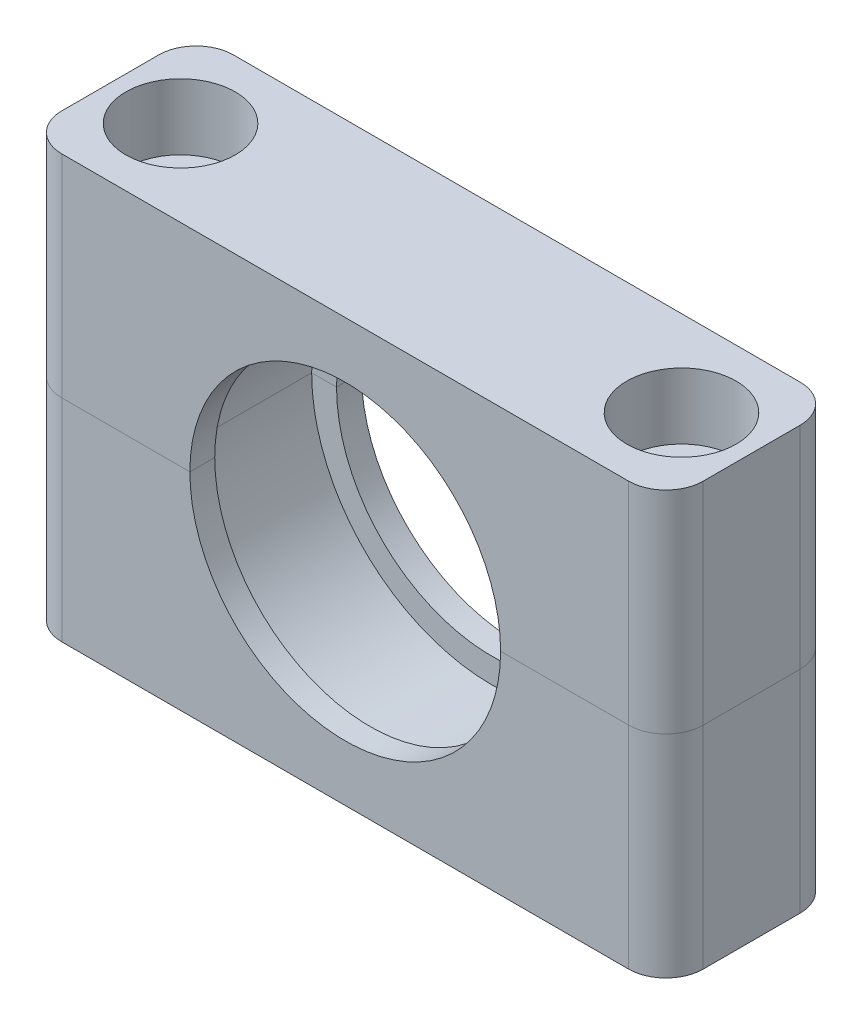
ISO-10303-21;
HEADER;
FILE_DESCRIPTION(('STEP AP214'),'2;1');
FILE_NAME('part.step','',(''),(''),'','','');
FILE_SCHEMA(('AUTOMOTIVE_DESIGN { 1 0 10303 214 1 1 1 1 }'));
ENDSEC;
DATA;
#1=APPLICATION_CONTEXT('core data for automotive mechanical design processes');
#2=APPLICATION_PROTOCOL_DEFINITION('international standard','automotive_design',2000,#1);
#3=PRODUCT_CONTEXT('',#1,'mechanical');
#4=PRODUCT('Part','Part','',(#3));
#5=PRODUCT_RELATED_PRODUCT_CATEGORY('part','',(#4));
#6=PRODUCT_DEFINITION_FORMATION('','',#4);
#7=PRODUCT_DEFINITION_CONTEXT('part definition',#1,'design');
#8=PRODUCT_DEFINITION('design','',#6,#7);
#9=PRODUCT_DEFINITION_SHAPE('','',#8);
#10=(LENGTH_UNIT() NAMED_UNIT(*) SI_UNIT(.MILLI.,.METRE.));
#11=(NAMED_UNIT(*) PLANE_ANGLE_UNIT() SI_UNIT($,.RADIAN.));
#12=(NAMED_UNIT(*) SI_UNIT($,.STERADIAN.) SOLID_ANGLE_UNIT());
#13=UNCERTAINTY_MEASURE_WITH_UNIT(LENGTH_MEASURE(1.E-05),#10,'distance_accuracy_value','');
#14=(GEOMETRIC_REPRESENTATION_CONTEXT(3) GLOBAL_UNCERTAINTY_ASSIGNED_CONTEXT((#13)) GLOBAL_UNIT_ASSIGNED_CONTEXT((#10,
#11,#12)) REPRESENTATION_CONTEXT('',''));
#15=CARTESIAN_POINT('',(0.,0.,0.));
#16=DIRECTION('',(0.,0.,1.));
#17=DIRECTION('',(1.,0.,0.));
#18=AXIS2_PLACEMENT_3D('',#15,#16,#17);
#19=CARTESIAN_POINT('',(0.,0.,0.));
#20=DIRECTION('',(0.,1.,0.));
#21=DIRECTION('',(0.,0.,1.));
#22=AXIS2_PLACEMENT_3D('',#19,#20,#21);
#23=PLANE('',#22);
#24=CARTESIAN_POINT('',(20.15,0.,4.75));
#25=DIRECTION('',(0.,1.,0.));
#26=DIRECTION('',(0.,0.,1.));
#27=AXIS2_PLACEMENT_3D('',#24,#25,#26);
#28=CIRCLE('',#27,2.65);
#29=CARTESIAN_POINT('',(20.15,0.,7.4));
#30=VERTEX_POINT('',#29);
#31=EDGE_CURVE('E243',#30,#30,#28,.F.);
#32=ORIENTED_EDGE('',*,*,#31,.T.);
#33=EDGE_LOOP('',(#32));
#34=FACE_BOUND('',#33,.T.);
#35=DIRECTION('',(-1.,0.,0.));
#36=VECTOR('',#35,1.);
#37=CARTESIAN_POINT('',(-25.8,0.,11.65));
#38=LINE('',#37,#36);
#39=CARTESIAN_POINT('',(22.8,0.,11.65));
#40=VERTEX_POINT('',#39);
#41=CARTESIAN_POINT('',(12.5,0.,11.65));
#42=VERTEX_POINT('',#41);
#43=EDGE_CURVE('E265',#40,#42,#38,.T.);
#44=ORIENTED_EDGE('',*,*,#43,.F.);
#45=CARTESIAN_POINT('',(22.8,0.,8.65));
#46=DIRECTION('',(0.,1.,0.));
#47=DIRECTION('',(0.,0.,1.));
#48=AXIS2_PLACEMENT_3D('',#45,#46,#47);
#49=CIRCLE('',#48,3.);
#50=CARTESIAN_POINT('',(25.8,0.,8.65));
#51=VERTEX_POINT('',#50);
#52=EDGE_CURVE('E199',#40,#51,#49,.T.);
#53=ORIENTED_EDGE('',*,*,#52,.T.);
#54=DIRECTION('',(0.,0.,1.));
#55=VECTOR('',#54,1.);
#56=CARTESIAN_POINT('',(25.8,0.,-2.15));
#57=LINE('',#56,#55);
#58=CARTESIAN_POINT('',(25.8,0.,0.850000000000002));
#59=VERTEX_POINT('',#58);
#60=EDGE_CURVE('E263',#59,#51,#57,.T.);
#61=ORIENTED_EDGE('',*,*,#60,.F.);
#62=CARTESIAN_POINT('',(22.8,0.,0.850000000000001));
#63=DIRECTION('',(0.,1.,0.));
#64=DIRECTION('',(0.,0.,1.));
#65=AXIS2_PLACEMENT_3D('',#62,#63,#64);
#66=CIRCLE('',#65,3.);
#67=CARTESIAN_POINT('',(22.8,0.,-2.15));
#68=VERTEX_POINT('',#67);
#69=EDGE_CURVE('E197',#59,#68,#66,.T.);
#70=ORIENTED_EDGE('',*,*,#69,.T.);
#71=DIRECTION('',(1.,0.,0.));
#72=VECTOR('',#71,1.);
#73=CARTESIAN_POINT('',(-25.8,0.,-2.15));
#74=LINE('',#73,#72);
#75=CARTESIAN_POINT('',(12.5,0.,-2.15));
#76=VERTEX_POINT('',#75);
#77=EDGE_CURVE('E232',#76,#68,#74,.T.);
#78=ORIENTED_EDGE('',*,*,#77,.F.);
#79=DIRECTION('',(0.,0.,-1.));
#80=VECTOR('',#79,1.);
#81=CARTESIAN_POINT('',(12.5,0.,-0.149999999999999));
#82=LINE('',#81,#80);
#83=CARTESIAN_POINT('',(12.5,0.,-0.149999999999999));
#84=VERTEX_POINT('',#83);
#85=EDGE_CURVE('E176',#76,#84,#82,.F.);
#86=ORIENTED_EDGE('',*,*,#85,.T.);
#87=DIRECTION('',(1.,0.,0.));
#88=VECTOR('',#87,1.);
#89=CARTESIAN_POINT('',(0.,0.,-0.149999999999999));
#90=LINE('',#89,#88);
#91=CARTESIAN_POINT('',(14.5,0.,-0.149999999999999));
#92=VERTEX_POINT('',#91);
#93=EDGE_CURVE('E157',#84,#92,#90,.T.);
#94=ORIENTED_EDGE('',*,*,#93,.T.);
#95=DIRECTION('',(0.,0.,1.));
#96=VECTOR('',#95,1.);
#97=CARTESIAN_POINT('',(14.5,0.,-2.15));
#98=LINE('',#97,#96);
#99=CARTESIAN_POINT('',(14.5,0.,9.65));
#100=VERTEX_POINT('',#99);
#101=EDGE_CURVE('E234',#92,#100,#98,.T.);
#102=ORIENTED_EDGE('',*,*,#101,.T.);
#103=DIRECTION('',(-1.,0.,0.));
#104=VECTOR('',#103,1.);
#105=CARTESIAN_POINT('',(0.,0.,9.65));
#106=LINE('',#105,#104);
#107=CARTESIAN_POINT('',(12.5,0.,9.65));
#108=VERTEX_POINT('',#107);
#109=EDGE_CURVE('E246',#100,#108,#106,.T.);
#110=ORIENTED_EDGE('',*,*,#109,.T.);
#111=DIRECTION('',(0.,0.,1.));
#112=VECTOR('',#111,1.);
#113=CARTESIAN_POINT('',(12.5,0.,9.65));
#114=LINE('',#113,#112);
#115=EDGE_CURVE('E172',#108,#42,#114,.T.);
#116=ORIENTED_EDGE('',*,*,#115,.T.);
#117=EDGE_LOOP('',(#44,#53,#61,#70,#78,#86,#94,#102,#110,#116));
#118=FACE_BOUND('',#117,.T.);
#119=ADVANCED_FACE('F50',(#34,#118),#23,.T.);
#120=CARTESIAN_POINT('',(-20.15,0.,4.75));
#121=DIRECTION('',(0.,1.,0.));
#122=DIRECTION('',(0.,0.,1.));
#123=AXIS2_PLACEMENT_3D('',#120,#121,#122);
#124=CIRCLE('',#123,2.65);
#125=CARTESIAN_POINT('',(-20.15,0.,7.4));
#126=VERTEX_POINT('',#125);
#127=EDGE_CURVE('E240',#126,#126,#124,.F.);
#128=ORIENTED_EDGE('',*,*,#127,.T.);
#129=EDGE_LOOP('',(#128));
#130=FACE_BOUND('',#129,.T.);
#131=CARTESIAN_POINT('',(-22.8,0.,-2.15));
#132=VERTEX_POINT('',#131);
#133=CARTESIAN_POINT('',(-12.5,0.,-2.15));
#134=VERTEX_POINT('',#133);
#135=EDGE_CURVE('E230',#132,#134,#74,.T.);
#136=ORIENTED_EDGE('',*,*,#135,.F.);
#137=CARTESIAN_POINT('',(-22.8,0.,0.850000000000001));
#138=DIRECTION('',(0.,1.,0.));
#139=DIRECTION('',(0.,0.,1.));
#140=AXIS2_PLACEMENT_3D('',#137,#138,#139);
#141=CIRCLE('',#140,3.);
#142=CARTESIAN_POINT('',(-25.8,0.,0.850000000000002));
#143=VERTEX_POINT('',#142);
#144=EDGE_CURVE('E65',#132,#143,#141,.T.);
#145=ORIENTED_EDGE('',*,*,#144,.T.);
#146=DIRECTION('',(0.,0.,-1.));
#147=VECTOR('',#146,1.);
#148=CARTESIAN_POINT('',(-25.8,0.,-2.15));
#149=LINE('',#148,#147);
#150=CARTESIAN_POINT('',(-25.8,0.,8.65));
#151=VERTEX_POINT('',#150);
#152=EDGE_CURVE('E223',#151,#143,#149,.T.);
#153=ORIENTED_EDGE('',*,*,#152,.F.);
#154=CARTESIAN_POINT('',(-22.8,0.,8.65));
#155=DIRECTION('',(0.,1.,0.));
#156=DIRECTION('',(0.,0.,1.));
#157=AXIS2_PLACEMENT_3D('',#154,#155,#156);
#158=CIRCLE('',#157,3.);
#159=CARTESIAN_POINT('',(-22.8,0.,11.65));
#160=VERTEX_POINT('',#159);
#161=EDGE_CURVE('E73',#151,#160,#158,.T.);
#162=ORIENTED_EDGE('',*,*,#161,.T.);
#163=CARTESIAN_POINT('',(-12.5,0.,11.65));
#164=VERTEX_POINT('',#163);
#165=EDGE_CURVE('E183',#164,#160,#38,.T.);
#166=ORIENTED_EDGE('',*,*,#165,.F.);
#167=DIRECTION('',(0.,0.,1.));
#168=VECTOR('',#167,1.);
#169=CARTESIAN_POINT('',(-12.5,0.,9.65));
#170=LINE('',#169,#168);
#171=CARTESIAN_POINT('',(-12.5,0.,9.65));
#172=VERTEX_POINT('',#171);
#173=EDGE_CURVE('E249',#164,#172,#170,.F.);
#174=ORIENTED_EDGE('',*,*,#173,.T.);
#175=CARTESIAN_POINT('',(-14.5,0.,9.65));
#176=VERTEX_POINT('',#175);
#177=EDGE_CURVE('E247',#172,#176,#106,.T.);
#178=ORIENTED_EDGE('',*,*,#177,.T.);
#179=DIRECTION('',(0.,0.,1.));
#180=VECTOR('',#179,1.);
#181=CARTESIAN_POINT('',(-14.5,0.,-2.15));
#182=LINE('',#181,#180);
#183=CARTESIAN_POINT('',(-14.5,0.,-0.149999999999999));
#184=VERTEX_POINT('',#183);
#185=EDGE_CURVE('E171',#176,#184,#182,.F.);
#186=ORIENTED_EDGE('',*,*,#185,.T.);
#187=CARTESIAN_POINT('',(-12.5,0.,-0.149999999999999));
#188=VERTEX_POINT('',#187);
#189=EDGE_CURVE('E155',#184,#188,#90,.T.);
#190=ORIENTED_EDGE('',*,*,#189,.T.);
#191=DIRECTION('',(0.,0.,-1.));
#192=VECTOR('',#191,1.);
#193=CARTESIAN_POINT('',(-12.5,0.,-0.149999999999999));
#194=LINE('',#193,#192);
#195=EDGE_CURVE('E168',#188,#134,#194,.T.);
#196=ORIENTED_EDGE('',*,*,#195,.T.);
#197=EDGE_LOOP('',(#136,#145,#153,#162,#166,#174,#178,#186,#190,#196));
#198=FACE_BOUND('',#197,.T.);
#199=ADVANCED_FACE('F167',(#130,#198),#23,.T.);
#200=CARTESIAN_POINT('',(0.,0.,-2.15));
#201=DIRECTION('',(0.,0.,1.));
#202=DIRECTION('',(1.,0.,0.));
#203=AXIS2_PLACEMENT_3D('',#200,#201,#202);
#204=CYLINDRICAL_SURFACE('',#203,14.5);
#205=ORIENTED_EDGE('',*,*,#185,.F.);
#206=CARTESIAN_POINT('',(0.,0.,9.65));
#207=DIRECTION('',(0.,0.,1.));
#208=DIRECTION('',(1.,0.,0.));
#209=AXIS2_PLACEMENT_3D('',#206,#207,#208);
#210=CIRCLE('',#209,14.5);
#211=EDGE_CURVE('E182',#100,#176,#210,.F.);
#212=ORIENTED_EDGE('',*,*,#211,.F.);
#213=ORIENTED_EDGE('',*,*,#101,.F.);
#214=CARTESIAN_POINT('',(0.,0.,-0.149999999999999));
#215=DIRECTION('',(0.,0.,-1.));
#216=DIRECTION('',(-1.,0.,0.));
#217=AXIS2_PLACEMENT_3D('',#214,#215,#216);
#218=CIRCLE('',#217,14.5);
#219=EDGE_CURVE('E180',#184,#92,#218,.F.);
#220=ORIENTED_EDGE('',*,*,#219,.F.);
#221=EDGE_LOOP('',(#205,#212,#213,#220));
#222=FACE_BOUND('',#221,.T.);
#223=ADVANCED_FACE('F305',(#222),#204,.F.);
#224=CARTESIAN_POINT('',(-25.8,-17.,-2.15));
#225=DIRECTION('',(-1.,0.,0.));
#226=DIRECTION('',(0.,0.,1.));
#227=AXIS2_PLACEMENT_3D('',#224,#225,#226);
#228=PLANE('',#227);
#229=ORIENTED_EDGE('',*,*,#152,.T.);
#230=DIRECTION('',(0.,1.,0.));
#231=VECTOR('',#230,1.);
#232=CARTESIAN_POINT('',(-25.8,-17.,0.850000000000002));
#233=LINE('',#232,#231);
#234=CARTESIAN_POINT('',(-25.8,-17.,0.850000000000002));
#235=VERTEX_POINT('',#234);
#236=EDGE_CURVE('E13',#143,#235,#233,.F.);
#237=ORIENTED_EDGE('',*,*,#236,.T.);
#238=DIRECTION('',(0.,0.,1.));
#239=VECTOR('',#238,1.);
#240=CARTESIAN_POINT('',(-25.8,-17.,-2.15));
#241=LINE('',#240,#239);
#242=CARTESIAN_POINT('',(-25.8,-17.,8.65));
#243=VERTEX_POINT('',#242);
#244=EDGE_CURVE('E226',#235,#243,#241,.T.);
#245=ORIENTED_EDGE('',*,*,#244,.T.);
#246=DIRECTION('',(0.,1.,0.));
#247=VECTOR('',#246,1.);
#248=CARTESIAN_POINT('',(-25.8,-17.,8.65));
#249=LINE('',#248,#247);
#250=EDGE_CURVE('E58',#243,#151,#249,.T.);
#251=ORIENTED_EDGE('',*,*,#250,.T.);
#252=EDGE_LOOP('',(#229,#237,#245,#251));
#253=FACE_BOUND('',#252,.T.);
#254=ADVANCED_FACE('F222',(#253),#228,.T.);
#255=CARTESIAN_POINT('',(-25.8,-17.,-2.15));
#256=DIRECTION('',(0.,0.,-1.));
#257=DIRECTION('',(-1.,0.,0.));
#258=AXIS2_PLACEMENT_3D('',#255,#256,#257);
#259=PLANE('',#258);
#260=ORIENTED_EDGE('',*,*,#77,.T.);
#261=DIRECTION('',(0.,1.,0.));
#262=VECTOR('',#261,1.);
#263=CARTESIAN_POINT('',(22.8,-17.,-2.15));
#264=LINE('',#263,#262);
#265=CARTESIAN_POINT('',(22.8,-17.,-2.15));
#266=VERTEX_POINT('',#265);
#267=EDGE_CURVE('E217',#68,#266,#264,.F.);
#268=ORIENTED_EDGE('',*,*,#267,.T.);
#269=DIRECTION('',(-1.,0.,0.));
#270=VECTOR('',#269,1.);
#271=CARTESIAN_POINT('',(-25.8,-17.,-2.15));
#272=LINE('',#271,#270);
#273=CARTESIAN_POINT('',(-22.8,-17.,-2.15));
#274=VERTEX_POINT('',#273);
#275=EDGE_CURVE('E185',#266,#274,#272,.T.);
#276=ORIENTED_EDGE('',*,*,#275,.T.);
#277=DIRECTION('',(0.,1.,0.));
#278=VECTOR('',#277,1.);
#279=CARTESIAN_POINT('',(-22.8,-17.,-2.15));
#280=LINE('',#279,#278);
#281=EDGE_CURVE('E214',#274,#132,#280,.T.);
#282=ORIENTED_EDGE('',*,*,#281,.T.);
#283=ORIENTED_EDGE('',*,*,#135,.T.);
#284=CARTESIAN_POINT('',(0.,0.,-2.15));
#285=DIRECTION('',(0.,0.,-1.));
#286=DIRECTION('',(-1.,0.,0.));
#287=AXIS2_PLACEMENT_3D('',#284,#285,#286);
#288=CIRCLE('',#287,12.5);
#289=EDGE_CURVE('E162',#76,#134,#288,.T.);
#290=ORIENTED_EDGE('',*,*,#289,.F.);
#291=EDGE_LOOP('',(#260,#268,#276,#282,#283,#290));
#292=FACE_BOUND('',#291,.T.);
#293=ADVANCED_FACE('F285',(#292),#259,.T.);
#294=CARTESIAN_POINT('',(25.8,-17.,-2.15));
#295=DIRECTION('',(1.,0.,0.));
#296=DIRECTION('',(0.,0.,-1.));
#297=AXIS2_PLACEMENT_3D('',#294,#295,#296);
#298=PLANE('',#297);
#299=ORIENTED_EDGE('',*,*,#60,.T.);
#300=DIRECTION('',(0.,1.,0.));
#301=VECTOR('',#300,1.);
#302=CARTESIAN_POINT('',(25.8,-17.,8.65));
#303=LINE('',#302,#301);
#304=CARTESIAN_POINT('',(25.8,-17.,8.65));
#305=VERTEX_POINT('',#304);
#306=EDGE_CURVE('E204',#51,#305,#303,.F.);
#307=ORIENTED_EDGE('',*,*,#306,.T.);
#308=DIRECTION('',(0.,0.,-1.));
#309=VECTOR('',#308,1.);
#310=CARTESIAN_POINT('',(25.8,-17.,-2.15));
#311=LINE('',#310,#309);
#312=CARTESIAN_POINT('',(25.8,-17.,0.850000000000002));
#313=VERTEX_POINT('',#312);
#314=EDGE_CURVE('E279',#305,#313,#311,.T.);
#315=ORIENTED_EDGE('',*,*,#314,.T.);
#316=DIRECTION('',(0.,1.,0.));
#317=VECTOR('',#316,1.);
#318=CARTESIAN_POINT('',(25.8,-17.,0.850000000000002));
#319=LINE('',#318,#317);
#320=EDGE_CURVE('E201',#313,#59,#319,.T.);
#321=ORIENTED_EDGE('',*,*,#320,.T.);
#322=EDGE_LOOP('',(#299,#307,#315,#321));
#323=FACE_BOUND('',#322,.T.);
#324=ADVANCED_FACE('F317',(#323),#298,.T.);
#325=CARTESIAN_POINT('',(-25.8,-17.,11.65));
#326=DIRECTION('',(0.,0.,1.));
#327=DIRECTION('',(1.,0.,0.));
#328=AXIS2_PLACEMENT_3D('',#325,#326,#327);
#329=PLANE('',#328);
#330=DIRECTION('',(1.,0.,0.));
#331=VECTOR('',#330,1.);
#332=CARTESIAN_POINT('',(-25.8,-17.,11.65));
#333=LINE('',#332,#331);
#334=CARTESIAN_POINT('',(-22.8,-17.,11.65));
#335=VERTEX_POINT('',#334);
#336=CARTESIAN_POINT('',(22.8,-17.,11.65));
#337=VERTEX_POINT('',#336);
#338=EDGE_CURVE('E276',#335,#337,#333,.T.);
#339=ORIENTED_EDGE('',*,*,#338,.T.);
#340=DIRECTION('',(0.,1.,0.));
#341=VECTOR('',#340,1.);
#342=CARTESIAN_POINT('',(22.8,-17.,11.65));
#343=LINE('',#342,#341);
#344=EDGE_CURVE('E194',#337,#40,#343,.T.);
#345=ORIENTED_EDGE('',*,*,#344,.T.);
#346=ORIENTED_EDGE('',*,*,#43,.T.);
#347=CARTESIAN_POINT('',(0.,0.,11.65));
#348=DIRECTION('',(0.,0.,1.));
#349=DIRECTION('',(1.,0.,0.));
#350=AXIS2_PLACEMENT_3D('',#347,#348,#349);
#351=CIRCLE('',#350,12.5);
#352=EDGE_CURVE('E163',#164,#42,#351,.T.);
#353=ORIENTED_EDGE('',*,*,#352,.F.);
#354=ORIENTED_EDGE('',*,*,#165,.T.);
#355=DIRECTION('',(0.,1.,0.));
#356=VECTOR('',#355,1.);
#357=CARTESIAN_POINT('',(-22.8,-17.,11.65));
#358=LINE('',#357,#356);
#359=EDGE_CURVE('E192',#160,#335,#358,.F.);
#360=ORIENTED_EDGE('',*,*,#359,.T.);
#361=EDGE_LOOP('',(#339,#345,#346,#353,#354,#360));
#362=FACE_BOUND('',#361,.T.);
#363=ADVANCED_FACE('F295',(#362),#329,.T.);
#364=CARTESIAN_POINT('',(-20.15,-17.,4.75));
#365=DIRECTION('',(0.,1.,0.));
#366=DIRECTION('',(0.,0.,1.));
#367=AXIS2_PLACEMENT_3D('',#364,#365,#366);
#368=CYLINDRICAL_SURFACE('',#367,2.65);
#369=CARTESIAN_POINT('',(-20.15,-17.,4.75));
#370=DIRECTION('',(0.,1.,0.));
#371=DIRECTION('',(0.,0.,1.));
#372=AXIS2_PLACEMENT_3D('',#369,#370,#371);
#373=CIRCLE('',#372,2.65);
#374=CARTESIAN_POINT('',(-20.15,-17.,7.4));
#375=VERTEX_POINT('',#374);
#376=EDGE_CURVE('E272',#375,#375,#373,.T.);
#377=ORIENTED_EDGE('',*,*,#376,.F.);
#378=EDGE_LOOP('',(#377));
#379=FACE_BOUND('',#378,.T.);
#380=ORIENTED_EDGE('',*,*,#127,.F.);
#381=EDGE_LOOP('',(#380));
#382=FACE_BOUND('',#381,.T.);
#383=ADVANCED_FACE('F330',(#379,#382),#368,.F.);
#384=CARTESIAN_POINT('',(20.15,-17.,4.75));
#385=DIRECTION('',(0.,1.,0.));
#386=DIRECTION('',(0.,0.,1.));
#387=AXIS2_PLACEMENT_3D('',#384,#385,#386);
#388=CYLINDRICAL_SURFACE('',#387,2.65);
#389=CARTESIAN_POINT('',(20.15,-17.,4.75));
#390=DIRECTION('',(0.,1.,0.));
#391=DIRECTION('',(0.,0.,-1.));
#392=AXIS2_PLACEMENT_3D('',#389,#390,#391);
#393=CIRCLE('',#392,2.65);
#394=CARTESIAN_POINT('',(20.15,-17.,2.1));
#395=VERTEX_POINT('',#394);
#396=EDGE_CURVE('E188',#395,#395,#393,.T.);
#397=ORIENTED_EDGE('',*,*,#396,.F.);
#398=EDGE_LOOP('',(#397));
#399=FACE_BOUND('',#398,.T.);
#400=ORIENTED_EDGE('',*,*,#31,.F.);
#401=EDGE_LOOP('',(#400));
#402=FACE_BOUND('',#401,.T.);
#403=ADVANCED_FACE('F327',(#399,#402),#388,.F.);
#404=CARTESIAN_POINT('',(0.,0.,9.65));
#405=DIRECTION('',(0.,0.,1.));
#406=DIRECTION('',(1.,0.,0.));
#407=AXIS2_PLACEMENT_3D('',#404,#405,#406);
#408=PLANE('',#407);
#409=ORIENTED_EDGE('',*,*,#109,.F.);
#410=ORIENTED_EDGE('',*,*,#211,.T.);
#411=ORIENTED_EDGE('',*,*,#177,.F.);
#412=CARTESIAN_POINT('',(0.,0.,9.65));
#413=DIRECTION('',(0.,0.,1.));
#414=DIRECTION('',(1.,0.,0.));
#415=AXIS2_PLACEMENT_3D('',#412,#413,#414);
#416=CIRCLE('',#415,12.5);
#417=EDGE_CURVE('E186',#172,#108,#416,.T.);
#418=ORIENTED_EDGE('',*,*,#417,.T.);
#419=EDGE_LOOP('',(#409,#410,#411,#418));
#420=FACE_BOUND('',#419,.T.);
#421=ADVANCED_FACE('F303',(#420),#408,.F.);
#422=CARTESIAN_POINT('',(0.,0.,9.65));
#423=DIRECTION('',(0.,0.,1.));
#424=DIRECTION('',(1.,0.,0.));
#425=AXIS2_PLACEMENT_3D('',#422,#423,#424);
#426=CYLINDRICAL_SURFACE('',#425,12.5);
#427=ORIENTED_EDGE('',*,*,#173,.F.);
#428=ORIENTED_EDGE('',*,*,#352,.T.);
#429=ORIENTED_EDGE('',*,*,#115,.F.);
#430=ORIENTED_EDGE('',*,*,#417,.F.);
#431=EDGE_LOOP('',(#427,#428,#429,#430));
#432=FACE_BOUND('',#431,.T.);
#433=ADVANCED_FACE('F299',(#432),#426,.F.);
#434=CARTESIAN_POINT('',(0.,0.,-0.149999999999999));
#435=DIRECTION('',(0.,0.,-1.));
#436=DIRECTION('',(-1.,0.,0.));
#437=AXIS2_PLACEMENT_3D('',#434,#435,#436);
#438=PLANE('',#437);
#439=ORIENTED_EDGE('',*,*,#189,.F.);
#440=ORIENTED_EDGE('',*,*,#219,.T.);
#441=ORIENTED_EDGE('',*,*,#93,.F.);
#442=CARTESIAN_POINT('',(0.,0.,-0.149999999999999));
#443=DIRECTION('',(0.,0.,-1.));
#444=DIRECTION('',(-1.,0.,0.));
#445=AXIS2_PLACEMENT_3D('',#442,#443,#444);
#446=CIRCLE('',#445,12.5);
#447=EDGE_CURVE('E152',#84,#188,#446,.T.);
#448=ORIENTED_EDGE('',*,*,#447,.T.);
#449=EDGE_LOOP('',(#439,#440,#441,#448));
#450=FACE_BOUND('',#449,.T.);
#451=ADVANCED_FACE('F154',(#450),#438,.F.);
#452=CARTESIAN_POINT('',(0.,0.,-0.149999999999999));
#453=DIRECTION('',(0.,0.,-1.));
#454=DIRECTION('',(-1.,0.,0.));
#455=AXIS2_PLACEMENT_3D('',#452,#453,#454);
#456=CYLINDRICAL_SURFACE('',#455,12.5);
#457=ORIENTED_EDGE('',*,*,#85,.F.);
#458=ORIENTED_EDGE('',*,*,#289,.T.);
#459=ORIENTED_EDGE('',*,*,#195,.F.);
#460=ORIENTED_EDGE('',*,*,#447,.F.);
#461=EDGE_LOOP('',(#457,#458,#459,#460));
#462=FACE_BOUND('',#461,.T.);
#463=ADVANCED_FACE('F175',(#462),#456,.F.);
#464=CARTESIAN_POINT('',(0.,-17.,0.));
#465=DIRECTION('',(0.,1.,0.));
#466=DIRECTION('',(0.,0.,1.));
#467=AXIS2_PLACEMENT_3D('',#464,#465,#466);
#468=PLANE('',#467);
#469=ORIENTED_EDGE('',*,*,#396,.T.);
#470=EDGE_LOOP('',(#469));
#471=FACE_BOUND('',#470,.T.);
#472=ORIENTED_EDGE('',*,*,#376,.T.);
#473=EDGE_LOOP('',(#472));
#474=FACE_BOUND('',#473,.T.);
#475=ORIENTED_EDGE('',*,*,#314,.F.);
#476=CARTESIAN_POINT('',(22.8,-17.,8.65));
#477=DIRECTION('',(0.,1.,0.));
#478=DIRECTION('',(0.,0.,1.));
#479=AXIS2_PLACEMENT_3D('',#476,#477,#478);
#480=CIRCLE('',#479,3.);
#481=EDGE_CURVE('E212',#305,#337,#480,.F.);
#482=ORIENTED_EDGE('',*,*,#481,.T.);
#483=ORIENTED_EDGE('',*,*,#338,.F.);
#484=CARTESIAN_POINT('',(-22.8,-17.,8.65));
#485=DIRECTION('',(0.,1.,0.));
#486=DIRECTION('',(0.,0.,1.));
#487=AXIS2_PLACEMENT_3D('',#484,#485,#486);
#488=CIRCLE('',#487,3.);
#489=EDGE_CURVE('E206',#335,#243,#488,.F.);
#490=ORIENTED_EDGE('',*,*,#489,.T.);
#491=ORIENTED_EDGE('',*,*,#244,.F.);
#492=CARTESIAN_POINT('',(-22.8,-17.,0.850000000000001));
#493=DIRECTION('',(0.,1.,0.));
#494=DIRECTION('',(0.,0.,1.));
#495=AXIS2_PLACEMENT_3D('',#492,#493,#494);
#496=CIRCLE('',#495,3.);
#497=EDGE_CURVE('E208',#235,#274,#496,.F.);
#498=ORIENTED_EDGE('',*,*,#497,.T.);
#499=ORIENTED_EDGE('',*,*,#275,.F.);
#500=CARTESIAN_POINT('',(22.8,-17.,0.850000000000001));
#501=DIRECTION('',(0.,1.,0.));
#502=DIRECTION('',(0.,0.,1.));
#503=AXIS2_PLACEMENT_3D('',#500,#501,#502);
#504=CIRCLE('',#503,3.);
#505=EDGE_CURVE('E210',#266,#313,#504,.F.);
#506=ORIENTED_EDGE('',*,*,#505,.T.);
#507=EDGE_LOOP('',(#475,#482,#483,#490,#491,#498,#499,#506));
#508=FACE_BOUND('',#507,.T.);
#509=ADVANCED_FACE('F292',(#471,#474,#508),#468,.F.);
#510=CARTESIAN_POINT('',(22.8,-17.,8.65));
#511=DIRECTION('',(0.,1.,0.));
#512=DIRECTION('',(0.,0.,1.));
#513=AXIS2_PLACEMENT_3D('',#510,#511,#512);
#514=CYLINDRICAL_SURFACE('',#513,3.);
#515=ORIENTED_EDGE('',*,*,#481,.F.);
#516=ORIENTED_EDGE('',*,*,#306,.F.);
#517=ORIENTED_EDGE('',*,*,#52,.F.);
#518=ORIENTED_EDGE('',*,*,#344,.F.);
#519=EDGE_LOOP('',(#515,#516,#517,#518));
#520=FACE_BOUND('',#519,.T.);
#521=ADVANCED_FACE('F333',(#520),#514,.T.);
#522=CARTESIAN_POINT('',(22.8,-17.,0.850000000000001));
#523=DIRECTION('',(0.,1.,0.));
#524=DIRECTION('',(0.,0.,1.));
#525=AXIS2_PLACEMENT_3D('',#522,#523,#524);
#526=CYLINDRICAL_SURFACE('',#525,3.);
#527=ORIENTED_EDGE('',*,*,#505,.F.);
#528=ORIENTED_EDGE('',*,*,#267,.F.);
#529=ORIENTED_EDGE('',*,*,#69,.F.);
#530=ORIENTED_EDGE('',*,*,#320,.F.);
#531=EDGE_LOOP('',(#527,#528,#529,#530));
#532=FACE_BOUND('',#531,.T.);
#533=ADVANCED_FACE('F336',(#532),#526,.T.);
#534=CARTESIAN_POINT('',(-22.8,-17.,0.850000000000001));
#535=DIRECTION('',(0.,1.,0.));
#536=DIRECTION('',(0.,0.,1.));
#537=AXIS2_PLACEMENT_3D('',#534,#535,#536);
#538=CYLINDRICAL_SURFACE('',#537,3.);
#539=ORIENTED_EDGE('',*,*,#497,.F.);
#540=ORIENTED_EDGE('',*,*,#236,.F.);
#541=ORIENTED_EDGE('',*,*,#144,.F.);
#542=ORIENTED_EDGE('',*,*,#281,.F.);
#543=EDGE_LOOP('',(#539,#540,#541,#542));
#544=FACE_BOUND('',#543,.T.);
#545=ADVANCED_FACE('F290',(#544),#538,.T.);
#546=CARTESIAN_POINT('',(-22.8,-17.,8.65));
#547=DIRECTION('',(0.,1.,0.));
#548=DIRECTION('',(0.,0.,1.));
#549=AXIS2_PLACEMENT_3D('',#546,#547,#548);
#550=CYLINDRICAL_SURFACE('',#549,3.);
#551=ORIENTED_EDGE('',*,*,#489,.F.);
#552=ORIENTED_EDGE('',*,*,#359,.F.);
#553=ORIENTED_EDGE('',*,*,#161,.F.);
#554=ORIENTED_EDGE('',*,*,#250,.F.);
#555=EDGE_LOOP('',(#551,#552,#553,#554));
#556=FACE_BOUND('',#555,.T.);
#557=ADVANCED_FACE('F52',(#556),#550,.T.);
#558=CLOSED_SHELL('',(#119,#199,#223,#254,#293,#324,#363,#383,#403,#421,#433,#451,#463,#509,
#521,#533,#545,#557));
#559=MANIFOLD_SOLID_BREP('B2',#558);
#560=CARTESIAN_POINT('',(20.15,-17.,4.75));
#561=DIRECTION('',(0.,1.,0.));
#562=DIRECTION('',(0.,0.,1.));
#563=AXIS2_PLACEMENT_3D('',#560,#561,#562);
#564=CYLINDRICAL_SURFACE('',#563,2.65);
#565=CARTESIAN_POINT('',(20.15,0.,4.75));
#566=DIRECTION('',(0.,1.,0.));
#567=DIRECTION('',(0.,0.,1.));
#568=AXIS2_PLACEMENT_3D('',#565,#566,#567);
#569=CIRCLE('',#568,2.65);
#570=CARTESIAN_POINT('',(20.15,0.,7.4));
#571=VERTEX_POINT('',#570);
#572=EDGE_CURVE('E682',#571,#571,#569,.F.);
#573=ORIENTED_EDGE('',*,*,#572,.T.);
#574=EDGE_LOOP('',(#573));
#575=FACE_BOUND('',#574,.T.);
#576=CARTESIAN_POINT('',(20.15,11.7,4.75));
#577=DIRECTION('',(0.,1.,0.));
#578=DIRECTION('',(0.,0.,1.));
#579=AXIS2_PLACEMENT_3D('',#576,#577,#578);
#580=CIRCLE('',#579,2.65);
#581=CARTESIAN_POINT('',(20.15,11.7,7.4));
#582=VERTEX_POINT('',#581);
#583=EDGE_CURVE('E703',#582,#582,#580,.F.);
#584=ORIENTED_EDGE('',*,*,#583,.F.);
#585=EDGE_LOOP('',(#584));
#586=FACE_BOUND('',#585,.T.);
#587=ADVANCED_FACE('F509',(#575,#586),#564,.F.);
#588=CARTESIAN_POINT('',(-20.15,-17.,4.75));
#589=DIRECTION('',(0.,1.,0.));
#590=DIRECTION('',(0.,0.,1.));
#591=AXIS2_PLACEMENT_3D('',#588,#589,#590);
#592=CYLINDRICAL_SURFACE('',#591,2.65);
#593=CARTESIAN_POINT('',(-20.15,0.,4.75));
#594=DIRECTION('',(0.,1.,0.));
#595=DIRECTION('',(0.,0.,1.));
#596=AXIS2_PLACEMENT_3D('',#593,#594,#595);
#597=CIRCLE('',#596,2.65);
#598=CARTESIAN_POINT('',(-20.15,0.,7.4));
#599=VERTEX_POINT('',#598);
#600=EDGE_CURVE('E692',#599,#599,#597,.F.);
#601=ORIENTED_EDGE('',*,*,#600,.T.);
#602=EDGE_LOOP('',(#601));
#603=FACE_BOUND('',#602,.T.);
#604=CARTESIAN_POINT('',(-20.15,11.7,4.75));
#605=DIRECTION('',(0.,1.,0.));
#606=DIRECTION('',(0.,0.,1.));
#607=AXIS2_PLACEMENT_3D('',#604,#605,#606);
#608=CIRCLE('',#607,2.65);
#609=CARTESIAN_POINT('',(-20.15,11.7,7.4));
#610=VERTEX_POINT('',#609);
#611=EDGE_CURVE('E700',#610,#610,#608,.F.);
#612=ORIENTED_EDGE('',*,*,#611,.F.);
#613=EDGE_LOOP('',(#612));
#614=FACE_BOUND('',#613,.T.);
#615=ADVANCED_FACE('F794',(#603,#614),#592,.F.);
#616=CARTESIAN_POINT('',(0.,0.,0.));
#617=DIRECTION('',(0.,1.,0.));
#618=DIRECTION('',(0.,0.,1.));
#619=AXIS2_PLACEMENT_3D('',#616,#617,#618);
#620=PLANE('',#619);
#621=DIRECTION('',(1.,0.,0.));
#622=VECTOR('',#621,1.);
#623=CARTESIAN_POINT('',(-25.8,0.,-2.15));
#624=LINE('',#623,#622);
#625=CARTESIAN_POINT('',(12.5,0.,-2.15));
#626=VERTEX_POINT('',#625);
#627=CARTESIAN_POINT('',(22.8,0.,-2.15));
#628=VERTEX_POINT('',#627);
#629=EDGE_CURVE('E671',#626,#628,#624,.T.);
#630=ORIENTED_EDGE('',*,*,#629,.T.);
#631=CARTESIAN_POINT('',(22.8,0.,0.850000000000001));
#632=DIRECTION('',(0.,1.,0.));
#633=DIRECTION('',(0.,0.,1.));
#634=AXIS2_PLACEMENT_3D('',#631,#632,#633);
#635=CIRCLE('',#634,3.);
#636=CARTESIAN_POINT('',(25.8,0.,0.850000000000002));
#637=VERTEX_POINT('',#636);
#638=EDGE_CURVE('E738',#628,#637,#635,.F.);
#639=ORIENTED_EDGE('',*,*,#638,.T.);
#640=DIRECTION('',(0.,0.,1.));
#641=VECTOR('',#640,1.);
#642=CARTESIAN_POINT('',(25.8,0.,-2.15));
#643=LINE('',#642,#641);
#644=CARTESIAN_POINT('',(25.8,0.,8.65));
#645=VERTEX_POINT('',#644);
#646=EDGE_CURVE('E674',#637,#645,#643,.T.);
#647=ORIENTED_EDGE('',*,*,#646,.T.);
#648=CARTESIAN_POINT('',(22.8,0.,8.65));
#649=DIRECTION('',(0.,1.,0.));
#650=DIRECTION('',(0.,0.,1.));
#651=AXIS2_PLACEMENT_3D('',#648,#649,#650);
#652=CIRCLE('',#651,3.);
#653=CARTESIAN_POINT('',(22.8,0.,11.65));
#654=VERTEX_POINT('',#653);
#655=EDGE_CURVE('E524',#645,#654,#652,.F.);
#656=ORIENTED_EDGE('',*,*,#655,.T.);
#657=DIRECTION('',(-1.,0.,0.));
#658=VECTOR('',#657,1.);
#659=CARTESIAN_POINT('',(-25.8,0.,11.65));
#660=LINE('',#659,#658);
#661=CARTESIAN_POINT('',(12.5,0.,11.65));
#662=VERTEX_POINT('',#661);
#663=EDGE_CURVE('E688',#654,#662,#660,.T.);
#664=ORIENTED_EDGE('',*,*,#663,.T.);
#665=DIRECTION('',(0.,0.,1.));
#666=VECTOR('',#665,1.);
#667=CARTESIAN_POINT('',(12.5,0.,9.65));
#668=LINE('',#667,#666);
#669=CARTESIAN_POINT('',(12.5,0.,9.65));
#670=VERTEX_POINT('',#669);
#671=EDGE_CURVE('E622',#670,#662,#668,.T.);
#672=ORIENTED_EDGE('',*,*,#671,.F.);
#673=DIRECTION('',(-1.,0.,0.));
#674=VECTOR('',#673,1.);
#675=CARTESIAN_POINT('',(0.,0.,9.65));
#676=LINE('',#675,#674);
#677=CARTESIAN_POINT('',(14.5,0.,9.65));
#678=VERTEX_POINT('',#677);
#679=EDGE_CURVE('E680',#678,#670,#676,.T.);
#680=ORIENTED_EDGE('',*,*,#679,.F.);
#681=DIRECTION('',(0.,0.,1.));
#682=VECTOR('',#681,1.);
#683=CARTESIAN_POINT('',(14.5,0.,-2.15));
#684=LINE('',#683,#682);
#685=CARTESIAN_POINT('',(14.5,0.,-0.149999999999999));
#686=VERTEX_POINT('',#685);
#687=EDGE_CURVE('E679',#686,#678,#684,.T.);
#688=ORIENTED_EDGE('',*,*,#687,.F.);
#689=DIRECTION('',(1.,0.,0.));
#690=VECTOR('',#689,1.);
#691=CARTESIAN_POINT('',(0.,0.,-0.149999999999999));
#692=LINE('',#691,#690);
#693=CARTESIAN_POINT('',(12.5,0.,-0.149999999999999));
#694=VERTEX_POINT('',#693);
#695=EDGE_CURVE('E623',#694,#686,#692,.T.);
#696=ORIENTED_EDGE('',*,*,#695,.F.);
#697=DIRECTION('',(0.,0.,-1.));
#698=VECTOR('',#697,1.);
#699=CARTESIAN_POINT('',(12.5,0.,-0.149999999999999));
#700=LINE('',#699,#698);
#701=EDGE_CURVE('E635',#626,#694,#700,.F.);
#702=ORIENTED_EDGE('',*,*,#701,.F.);
#703=EDGE_LOOP('',(#630,#639,#647,#656,#664,#672,#680,#688,#696,#702));
#704=FACE_BOUND('',#703,.T.);
#705=ORIENTED_EDGE('',*,*,#572,.F.);
#706=EDGE_LOOP('',(#705));
#707=FACE_BOUND('',#706,.T.);
#708=ADVANCED_FACE('F765',(#704,#707),#620,.F.);
#709=DIRECTION('',(0.,0.,-1.));
#710=VECTOR('',#709,1.);
#711=CARTESIAN_POINT('',(-25.8,0.,-2.15));
#712=LINE('',#711,#710);
#713=CARTESIAN_POINT('',(-25.8,0.,8.65));
#714=VERTEX_POINT('',#713);
#715=CARTESIAN_POINT('',(-25.8,0.,0.850000000000002));
#716=VERTEX_POINT('',#715);
#717=EDGE_CURVE('E675',#714,#716,#712,.T.);
#718=ORIENTED_EDGE('',*,*,#717,.T.);
#719=CARTESIAN_POINT('',(-22.8,0.,0.850000000000001));
#720=DIRECTION('',(0.,1.,0.));
#721=DIRECTION('',(0.,0.,1.));
#722=AXIS2_PLACEMENT_3D('',#719,#720,#721);
#723=CIRCLE('',#722,3.);
#724=CARTESIAN_POINT('',(-22.8,0.,-2.15));
#725=VERTEX_POINT('',#724);
#726=EDGE_CURVE('E731',#716,#725,#723,.F.);
#727=ORIENTED_EDGE('',*,*,#726,.T.);
#728=CARTESIAN_POINT('',(-12.5,0.,-2.15));
#729=VERTEX_POINT('',#728);
#730=EDGE_CURVE('E631',#725,#729,#624,.T.);
#731=ORIENTED_EDGE('',*,*,#730,.T.);
#732=DIRECTION('',(0.,0.,-1.));
#733=VECTOR('',#732,1.);
#734=CARTESIAN_POINT('',(-12.5,0.,-0.149999999999999));
#735=LINE('',#734,#733);
#736=CARTESIAN_POINT('',(-12.5,0.,-0.149999999999999));
#737=VERTEX_POINT('',#736);
#738=EDGE_CURVE('E626',#737,#729,#735,.T.);
#739=ORIENTED_EDGE('',*,*,#738,.F.);
#740=CARTESIAN_POINT('',(-14.5,0.,-0.149999999999999));
#741=VERTEX_POINT('',#740);
#742=EDGE_CURVE('E613',#741,#737,#692,.T.);
#743=ORIENTED_EDGE('',*,*,#742,.F.);
#744=DIRECTION('',(0.,0.,1.));
#745=VECTOR('',#744,1.);
#746=CARTESIAN_POINT('',(-14.5,0.,-2.15));
#747=LINE('',#746,#745);
#748=CARTESIAN_POINT('',(-14.5,0.,9.65));
#749=VERTEX_POINT('',#748);
#750=EDGE_CURVE('E677',#749,#741,#747,.F.);
#751=ORIENTED_EDGE('',*,*,#750,.F.);
#752=CARTESIAN_POINT('',(-12.5,0.,9.65));
#753=VERTEX_POINT('',#752);
#754=EDGE_CURVE('E683',#753,#749,#676,.T.);
#755=ORIENTED_EDGE('',*,*,#754,.F.);
#756=DIRECTION('',(0.,0.,1.));
#757=VECTOR('',#756,1.);
#758=CARTESIAN_POINT('',(-12.5,0.,9.65));
#759=LINE('',#758,#757);
#760=CARTESIAN_POINT('',(-12.5,0.,11.65));
#761=VERTEX_POINT('',#760);
#762=EDGE_CURVE('E689',#761,#753,#759,.F.);
#763=ORIENTED_EDGE('',*,*,#762,.F.);
#764=CARTESIAN_POINT('',(-22.8,0.,11.65));
#765=VERTEX_POINT('',#764);
#766=EDGE_CURVE('E684',#761,#765,#660,.T.);
#767=ORIENTED_EDGE('',*,*,#766,.T.);
#768=CARTESIAN_POINT('',(-22.8,0.,8.65));
#769=DIRECTION('',(0.,1.,0.));
#770=DIRECTION('',(0.,0.,1.));
#771=AXIS2_PLACEMENT_3D('',#768,#769,#770);
#772=CIRCLE('',#771,3.);
#773=EDGE_CURVE('E729',#765,#714,#772,.F.);
#774=ORIENTED_EDGE('',*,*,#773,.T.);
#775=EDGE_LOOP('',(#718,#727,#731,#739,#743,#751,#755,#763,#767,#774));
#776=FACE_BOUND('',#775,.T.);
#777=ORIENTED_EDGE('',*,*,#600,.F.);
#778=EDGE_LOOP('',(#777));
#779=FACE_BOUND('',#778,.T.);
#780=ADVANCED_FACE('F628',(#776,#779),#620,.F.);
#781=CARTESIAN_POINT('',(-25.8,-17.,-2.15));
#782=DIRECTION('',(-1.,0.,0.));
#783=DIRECTION('',(0.,0.,1.));
#784=AXIS2_PLACEMENT_3D('',#781,#782,#783);
#785=PLANE('',#784);
#786=DIRECTION('',(0.,0.,1.));
#787=VECTOR('',#786,1.);
#788=CARTESIAN_POINT('',(-25.8,17.,-2.15));
#789=LINE('',#788,#787);
#790=CARTESIAN_POINT('',(-25.8,17.,0.850000000000002));
#791=VERTEX_POINT('',#790);
#792=CARTESIAN_POINT('',(-25.8,17.,8.65));
#793=VERTEX_POINT('',#792);
#794=EDGE_CURVE('E653',#791,#793,#789,.T.);
#795=ORIENTED_EDGE('',*,*,#794,.F.);
#796=DIRECTION('',(0.,1.,0.));
#797=VECTOR('',#796,1.);
#798=CARTESIAN_POINT('',(-25.8,-17.,0.850000000000002));
#799=LINE('',#798,#797);
#800=EDGE_CURVE('E727',#791,#716,#799,.F.);
#801=ORIENTED_EDGE('',*,*,#800,.T.);
#802=ORIENTED_EDGE('',*,*,#717,.F.);
#803=DIRECTION('',(0.,1.,0.));
#804=VECTOR('',#803,1.);
#805=CARTESIAN_POINT('',(-25.8,-17.,8.65));
#806=LINE('',#805,#804);
#807=EDGE_CURVE('E724',#714,#793,#806,.T.);
#808=ORIENTED_EDGE('',*,*,#807,.T.);
#809=EDGE_LOOP('',(#795,#801,#802,#808));
#810=FACE_BOUND('',#809,.T.);
#811=ADVANCED_FACE('F752',(#810),#785,.T.);
#812=CARTESIAN_POINT('',(0.,17.,0.));
#813=DIRECTION('',(0.,1.,0.));
#814=DIRECTION('',(0.,0.,1.));
#815=AXIS2_PLACEMENT_3D('',#812,#813,#814);
#816=PLANE('',#815);
#817=CARTESIAN_POINT('',(-20.15,17.,4.75));
#818=DIRECTION('',(0.,1.,0.));
#819=DIRECTION('',(0.,0.,1.));
#820=AXIS2_PLACEMENT_3D('',#817,#818,#819);
#821=CIRCLE('',#820,4.4);
#822=CARTESIAN_POINT('',(-20.15,17.,9.15));
#823=VERTEX_POINT('',#822);
#824=EDGE_CURVE('E646',#823,#823,#821,.F.);
#825=ORIENTED_EDGE('',*,*,#824,.T.);
#826=EDGE_LOOP('',(#825));
#827=FACE_BOUND('',#826,.T.);
#828=CARTESIAN_POINT('',(20.15,17.,4.75));
#829=DIRECTION('',(0.,1.,0.));
#830=DIRECTION('',(0.,0.,1.));
#831=AXIS2_PLACEMENT_3D('',#828,#829,#830);
#832=CIRCLE('',#831,4.4);
#833=CARTESIAN_POINT('',(20.15,17.,9.15));
#834=VERTEX_POINT('',#833);
#835=EDGE_CURVE('E707',#834,#834,#832,.F.);
#836=ORIENTED_EDGE('',*,*,#835,.T.);
#837=EDGE_LOOP('',(#836));
#838=FACE_BOUND('',#837,.T.);
#839=DIRECTION('',(-1.,0.,0.));
#840=VECTOR('',#839,1.);
#841=CARTESIAN_POINT('',(-25.8,17.,-2.15));
#842=LINE('',#841,#840);
#843=CARTESIAN_POINT('',(22.8,17.,-2.15));
#844=VERTEX_POINT('',#843);
#845=CARTESIAN_POINT('',(-22.8,17.,-2.15));
#846=VERTEX_POINT('',#845);
#847=EDGE_CURVE('E663',#844,#846,#842,.T.);
#848=ORIENTED_EDGE('',*,*,#847,.T.);
#849=CARTESIAN_POINT('',(-22.8,17.,0.850000000000001));
#850=DIRECTION('',(0.,1.,0.));
#851=DIRECTION('',(0.,0.,1.));
#852=AXIS2_PLACEMENT_3D('',#849,#850,#851);
#853=CIRCLE('',#852,3.);
#854=EDGE_CURVE('E722',#846,#791,#853,.T.);
#855=ORIENTED_EDGE('',*,*,#854,.T.);
#856=ORIENTED_EDGE('',*,*,#794,.T.);
#857=CARTESIAN_POINT('',(-22.8,17.,8.65));
#858=DIRECTION('',(0.,1.,0.));
#859=DIRECTION('',(0.,0.,1.));
#860=AXIS2_PLACEMENT_3D('',#857,#858,#859);
#861=CIRCLE('',#860,3.);
#862=CARTESIAN_POINT('',(-22.8,17.,11.65));
#863=VERTEX_POINT('',#862);
#864=EDGE_CURVE('E716',#793,#863,#861,.T.);
#865=ORIENTED_EDGE('',*,*,#864,.T.);
#866=DIRECTION('',(1.,0.,0.));
#867=VECTOR('',#866,1.);
#868=CARTESIAN_POINT('',(-25.8,17.,11.65));
#869=LINE('',#868,#867);
#870=CARTESIAN_POINT('',(22.8,17.,11.65));
#871=VERTEX_POINT('',#870);
#872=EDGE_CURVE('E657',#863,#871,#869,.T.);
#873=ORIENTED_EDGE('',*,*,#872,.T.);
#874=CARTESIAN_POINT('',(22.8,17.,8.65));
#875=DIRECTION('',(0.,1.,0.));
#876=DIRECTION('',(0.,0.,1.));
#877=AXIS2_PLACEMENT_3D('',#874,#875,#876);
#878=CIRCLE('',#877,3.);
#879=CARTESIAN_POINT('',(25.8,17.,8.65));
#880=VERTEX_POINT('',#879);
#881=EDGE_CURVE('E718',#871,#880,#878,.T.);
#882=ORIENTED_EDGE('',*,*,#881,.T.);
#883=DIRECTION('',(0.,0.,-1.));
#884=VECTOR('',#883,1.);
#885=CARTESIAN_POINT('',(25.8,17.,-2.15));
#886=LINE('',#885,#884);
#887=CARTESIAN_POINT('',(25.8,17.,0.850000000000002));
#888=VERTEX_POINT('',#887);
#889=EDGE_CURVE('E660',#880,#888,#886,.T.);
#890=ORIENTED_EDGE('',*,*,#889,.T.);
#891=CARTESIAN_POINT('',(22.8,17.,0.850000000000001));
#892=DIRECTION('',(0.,1.,0.));
#893=DIRECTION('',(0.,0.,1.));
#894=AXIS2_PLACEMENT_3D('',#891,#892,#893);
#895=CIRCLE('',#894,3.);
#896=EDGE_CURVE('E720',#888,#844,#895,.T.);
#897=ORIENTED_EDGE('',*,*,#896,.T.);
#898=EDGE_LOOP('',(#848,#855,#856,#865,#873,#882,#890,#897));
#899=FACE_BOUND('',#898,.T.);
#900=ADVANCED_FACE('F755',(#827,#838,#899),#816,.T.);
#901=CARTESIAN_POINT('',(25.8,-17.,-2.15));
#902=DIRECTION('',(1.,0.,0.));
#903=DIRECTION('',(0.,0.,-1.));
#904=AXIS2_PLACEMENT_3D('',#901,#902,#903);
#905=PLANE('',#904);
#906=ORIENTED_EDGE('',*,*,#646,.F.);
#907=DIRECTION('',(0.,1.,0.));
#908=VECTOR('',#907,1.);
#909=CARTESIAN_POINT('',(25.8,-17.,0.850000000000002));
#910=LINE('',#909,#908);
#911=EDGE_CURVE('E734',#637,#888,#910,.T.);
#912=ORIENTED_EDGE('',*,*,#911,.T.);
#913=ORIENTED_EDGE('',*,*,#889,.F.);
#914=DIRECTION('',(0.,1.,0.));
#915=VECTOR('',#914,1.);
#916=CARTESIAN_POINT('',(25.8,-17.,8.65));
#917=LINE('',#916,#915);
#918=EDGE_CURVE('E532',#880,#645,#917,.F.);
#919=ORIENTED_EDGE('',*,*,#918,.T.);
#920=EDGE_LOOP('',(#906,#912,#913,#919));
#921=FACE_BOUND('',#920,.T.);
#922=ADVANCED_FACE('F781',(#921),#905,.T.);
#923=CARTESIAN_POINT('',(0.,0.,-2.15));
#924=DIRECTION('',(0.,0.,1.));
#925=DIRECTION('',(1.,0.,0.));
#926=AXIS2_PLACEMENT_3D('',#923,#924,#925);
#927=CYLINDRICAL_SURFACE('',#926,14.5);
#928=CARTESIAN_POINT('',(0.,0.,9.65));
#929=DIRECTION('',(0.,0.,1.));
#930=DIRECTION('',(1.,0.,0.));
#931=AXIS2_PLACEMENT_3D('',#928,#929,#930);
#932=CIRCLE('',#931,14.5);
#933=EDGE_CURVE('E666',#749,#678,#932,.F.);
#934=ORIENTED_EDGE('',*,*,#933,.F.);
#935=ORIENTED_EDGE('',*,*,#750,.T.);
#936=CARTESIAN_POINT('',(0.,0.,-0.149999999999999));
#937=DIRECTION('',(0.,0.,-1.));
#938=DIRECTION('',(-1.,0.,0.));
#939=AXIS2_PLACEMENT_3D('',#936,#937,#938);
#940=CIRCLE('',#939,14.5);
#941=EDGE_CURVE('E619',#686,#741,#940,.F.);
#942=ORIENTED_EDGE('',*,*,#941,.F.);
#943=ORIENTED_EDGE('',*,*,#687,.T.);
#944=EDGE_LOOP('',(#934,#935,#942,#943));
#945=FACE_BOUND('',#944,.T.);
#946=ADVANCED_FACE('F772',(#945),#927,.F.);
#947=CARTESIAN_POINT('',(0.,0.,-0.149999999999999));
#948=DIRECTION('',(0.,0.,-1.));
#949=DIRECTION('',(-1.,0.,0.));
#950=AXIS2_PLACEMENT_3D('',#947,#948,#949);
#951=PLANE('',#950);
#952=ORIENTED_EDGE('',*,*,#941,.T.);
#953=ORIENTED_EDGE('',*,*,#742,.T.);
#954=CARTESIAN_POINT('',(0.,0.,-0.149999999999999));
#955=DIRECTION('',(0.,0.,-1.));
#956=DIRECTION('',(-1.,0.,0.));
#957=AXIS2_PLACEMENT_3D('',#954,#955,#956);
#958=CIRCLE('',#957,12.5);
#959=EDGE_CURVE('E617',#737,#694,#958,.T.);
#960=ORIENTED_EDGE('',*,*,#959,.T.);
#961=ORIENTED_EDGE('',*,*,#695,.T.);
#962=EDGE_LOOP('',(#952,#953,#960,#961));
#963=FACE_BOUND('',#962,.T.);
#964=ADVANCED_FACE('F615',(#963),#951,.F.);
#965=CARTESIAN_POINT('',(-25.8,-17.,-2.15));
#966=DIRECTION('',(0.,0.,-1.));
#967=DIRECTION('',(-1.,0.,0.));
#968=AXIS2_PLACEMENT_3D('',#965,#966,#967);
#969=PLANE('',#968);
#970=ORIENTED_EDGE('',*,*,#730,.F.);
#971=DIRECTION('',(0.,1.,0.));
#972=VECTOR('',#971,1.);
#973=CARTESIAN_POINT('',(-22.8,-17.,-2.15));
#974=LINE('',#973,#972);
#975=EDGE_CURVE('E713',#725,#846,#974,.T.);
#976=ORIENTED_EDGE('',*,*,#975,.T.);
#977=ORIENTED_EDGE('',*,*,#847,.F.);
#978=DIRECTION('',(0.,1.,0.));
#979=VECTOR('',#978,1.);
#980=CARTESIAN_POINT('',(22.8,-17.,-2.15));
#981=LINE('',#980,#979);
#982=EDGE_CURVE('E687',#844,#628,#981,.F.);
#983=ORIENTED_EDGE('',*,*,#982,.T.);
#984=ORIENTED_EDGE('',*,*,#629,.F.);
#985=CARTESIAN_POINT('',(0.,0.,-2.15));
#986=DIRECTION('',(0.,0.,-1.));
#987=DIRECTION('',(-1.,0.,0.));
#988=AXIS2_PLACEMENT_3D('',#985,#986,#987);
#989=CIRCLE('',#988,12.5);
#990=EDGE_CURVE('E641',#729,#626,#989,.T.);
#991=ORIENTED_EDGE('',*,*,#990,.F.);
#992=EDGE_LOOP('',(#970,#976,#977,#983,#984,#991));
#993=FACE_BOUND('',#992,.T.);
#994=ADVANCED_FACE('F762',(#993),#969,.T.);
#995=CARTESIAN_POINT('',(0.,0.,-0.149999999999999));
#996=DIRECTION('',(0.,0.,-1.));
#997=DIRECTION('',(-1.,0.,0.));
#998=AXIS2_PLACEMENT_3D('',#995,#996,#997);
#999=CYLINDRICAL_SURFACE('',#998,12.5);
#1000=ORIENTED_EDGE('',*,*,#990,.T.);
#1001=ORIENTED_EDGE('',*,*,#701,.T.);
#1002=ORIENTED_EDGE('',*,*,#959,.F.);
#1003=ORIENTED_EDGE('',*,*,#738,.T.);
#1004=EDGE_LOOP('',(#1000,#1001,#1002,#1003));
#1005=FACE_BOUND('',#1004,.T.);
#1006=ADVANCED_FACE('F637',(#1005),#999,.F.);
#1007=CARTESIAN_POINT('',(0.,0.,9.65));
#1008=DIRECTION('',(0.,0.,1.));
#1009=DIRECTION('',(1.,0.,0.));
#1010=AXIS2_PLACEMENT_3D('',#1007,#1008,#1009);
#1011=PLANE('',#1010);
#1012=ORIENTED_EDGE('',*,*,#933,.T.);
#1013=ORIENTED_EDGE('',*,*,#679,.T.);
#1014=CARTESIAN_POINT('',(0.,0.,9.65));
#1015=DIRECTION('',(0.,0.,1.));
#1016=DIRECTION('',(1.,0.,0.));
#1017=AXIS2_PLACEMENT_3D('',#1014,#1015,#1016);
#1018=CIRCLE('',#1017,12.5);
#1019=EDGE_CURVE('E644',#670,#753,#1018,.T.);
#1020=ORIENTED_EDGE('',*,*,#1019,.T.);
#1021=ORIENTED_EDGE('',*,*,#754,.T.);
#1022=EDGE_LOOP('',(#1012,#1013,#1020,#1021));
#1023=FACE_BOUND('',#1022,.T.);
#1024=ADVANCED_FACE('F775',(#1023),#1011,.F.);
#1025=CARTESIAN_POINT('',(-25.8,-17.,11.65));
#1026=DIRECTION('',(0.,0.,1.));
#1027=DIRECTION('',(1.,0.,0.));
#1028=AXIS2_PLACEMENT_3D('',#1025,#1026,#1027);
#1029=PLANE('',#1028);
#1030=ORIENTED_EDGE('',*,*,#663,.F.);
#1031=DIRECTION('',(0.,1.,0.));
#1032=VECTOR('',#1031,1.);
#1033=CARTESIAN_POINT('',(22.8,-17.,11.65));
#1034=LINE('',#1033,#1032);
#1035=EDGE_CURVE('E48',#654,#871,#1034,.T.);
#1036=ORIENTED_EDGE('',*,*,#1035,.T.);
#1037=ORIENTED_EDGE('',*,*,#872,.F.);
#1038=DIRECTION('',(0.,1.,0.));
#1039=VECTOR('',#1038,1.);
#1040=CARTESIAN_POINT('',(-22.8,-17.,11.65));
#1041=LINE('',#1040,#1039);
#1042=EDGE_CURVE('E517',#863,#765,#1041,.F.);
#1043=ORIENTED_EDGE('',*,*,#1042,.T.);
#1044=ORIENTED_EDGE('',*,*,#766,.F.);
#1045=CARTESIAN_POINT('',(0.,0.,11.65));
#1046=DIRECTION('',(0.,0.,1.));
#1047=DIRECTION('',(1.,0.,0.));
#1048=AXIS2_PLACEMENT_3D('',#1045,#1046,#1047);
#1049=CIRCLE('',#1048,12.5);
#1050=EDGE_CURVE('E640',#662,#761,#1049,.T.);
#1051=ORIENTED_EDGE('',*,*,#1050,.F.);
#1052=EDGE_LOOP('',(#1030,#1036,#1037,#1043,#1044,#1051));
#1053=FACE_BOUND('',#1052,.T.);
#1054=ADVANCED_FACE('F743',(#1053),#1029,.T.);
#1055=CARTESIAN_POINT('',(0.,0.,9.65));
#1056=DIRECTION('',(0.,0.,1.));
#1057=DIRECTION('',(1.,0.,0.));
#1058=AXIS2_PLACEMENT_3D('',#1055,#1056,#1057);
#1059=CYLINDRICAL_SURFACE('',#1058,12.5);
#1060=ORIENTED_EDGE('',*,*,#1050,.T.);
#1061=ORIENTED_EDGE('',*,*,#762,.T.);
#1062=ORIENTED_EDGE('',*,*,#1019,.F.);
#1063=ORIENTED_EDGE('',*,*,#671,.T.);
#1064=EDGE_LOOP('',(#1060,#1061,#1062,#1063));
#1065=FACE_BOUND('',#1064,.T.);
#1066=ADVANCED_FACE('F777',(#1065),#1059,.F.);
#1067=CARTESIAN_POINT('',(-20.15,11.7,4.75));
#1068=DIRECTION('',(0.,1.,0.));
#1069=DIRECTION('',(0.,0.,1.));
#1070=AXIS2_PLACEMENT_3D('',#1067,#1068,#1069);
#1071=PLANE('',#1070);
#1072=CARTESIAN_POINT('',(-20.15,11.7,4.75));
#1073=DIRECTION('',(0.,1.,0.));
#1074=DIRECTION('',(0.,0.,1.));
#1075=AXIS2_PLACEMENT_3D('',#1072,#1073,#1074);
#1076=CIRCLE('',#1075,4.4);
#1077=CARTESIAN_POINT('',(-20.15,11.7,9.15));
#1078=VERTEX_POINT('',#1077);
#1079=EDGE_CURVE('E704',#1078,#1078,#1076,.T.);
#1080=ORIENTED_EDGE('',*,*,#1079,.T.);
#1081=EDGE_LOOP('',(#1080));
#1082=FACE_BOUND('',#1081,.T.);
#1083=ORIENTED_EDGE('',*,*,#611,.T.);
#1084=EDGE_LOOP('',(#1083));
#1085=FACE_BOUND('',#1084,.T.);
#1086=ADVANCED_FACE('F817',(#1082,#1085),#1071,.T.);
#1087=CARTESIAN_POINT('',(-20.15,17.000012,4.75));
#1088=DIRECTION('',(0.,-1.,0.));
#1089=DIRECTION('',(0.,0.,-1.));
#1090=AXIS2_PLACEMENT_3D('',#1087,#1088,#1089);
#1091=CYLINDRICAL_SURFACE('',#1090,4.4);
#1092=ORIENTED_EDGE('',*,*,#824,.F.);
#1093=EDGE_LOOP('',(#1092));
#1094=FACE_BOUND('',#1093,.T.);
#1095=ORIENTED_EDGE('',*,*,#1079,.F.);
#1096=EDGE_LOOP('',(#1095));
#1097=FACE_BOUND('',#1096,.T.);
#1098=ADVANCED_FACE('F827',(#1094,#1097),#1091,.F.);
#1099=CARTESIAN_POINT('',(20.15,11.7,4.75));
#1100=DIRECTION('',(0.,1.,0.));
#1101=DIRECTION('',(0.,0.,1.));
#1102=AXIS2_PLACEMENT_3D('',#1099,#1100,#1101);
#1103=PLANE('',#1102);
#1104=CARTESIAN_POINT('',(20.15,11.7,4.75));
#1105=DIRECTION('',(0.,1.,0.));
#1106=DIRECTION('',(0.,0.,1.));
#1107=AXIS2_PLACEMENT_3D('',#1104,#1105,#1106);
#1108=CIRCLE('',#1107,4.4);
#1109=CARTESIAN_POINT('',(20.15,11.7,9.15));
#1110=VERTEX_POINT('',#1109);
#1111=EDGE_CURVE('E649',#1110,#1110,#1108,.T.);
#1112=ORIENTED_EDGE('',*,*,#1111,.T.);
#1113=EDGE_LOOP('',(#1112));
#1114=FACE_BOUND('',#1113,.T.);
#1115=ORIENTED_EDGE('',*,*,#583,.T.);
#1116=EDGE_LOOP('',(#1115));
#1117=FACE_BOUND('',#1116,.T.);
#1118=ADVANCED_FACE('F839',(#1114,#1117),#1103,.T.);
#1119=CARTESIAN_POINT('',(20.15,17.000012,4.75));
#1120=DIRECTION('',(0.,-1.,0.));
#1121=DIRECTION('',(0.,0.,-1.));
#1122=AXIS2_PLACEMENT_3D('',#1119,#1120,#1121);
#1123=CYLINDRICAL_SURFACE('',#1122,4.4);
#1124=ORIENTED_EDGE('',*,*,#835,.F.);
#1125=EDGE_LOOP('',(#1124));
#1126=FACE_BOUND('',#1125,.T.);
#1127=ORIENTED_EDGE('',*,*,#1111,.F.);
#1128=EDGE_LOOP('',(#1127));
#1129=FACE_BOUND('',#1128,.T.);
#1130=ADVANCED_FACE('F791',(#1126,#1129),#1123,.F.);
#1131=CARTESIAN_POINT('',(-22.8,-17.,0.850000000000001));
#1132=DIRECTION('',(0.,1.,0.));
#1133=DIRECTION('',(0.,0.,1.));
#1134=AXIS2_PLACEMENT_3D('',#1131,#1132,#1133);
#1135=CYLINDRICAL_SURFACE('',#1134,3.);
#1136=ORIENTED_EDGE('',*,*,#726,.F.);
#1137=ORIENTED_EDGE('',*,*,#800,.F.);
#1138=ORIENTED_EDGE('',*,*,#854,.F.);
#1139=ORIENTED_EDGE('',*,*,#975,.F.);
#1140=EDGE_LOOP('',(#1136,#1137,#1138,#1139));
#1141=FACE_BOUND('',#1140,.T.);
#1142=ADVANCED_FACE('F760',(#1141),#1135,.T.);
#1143=CARTESIAN_POINT('',(22.8,-17.,0.850000000000001));
#1144=DIRECTION('',(0.,1.,0.));
#1145=DIRECTION('',(0.,0.,1.));
#1146=AXIS2_PLACEMENT_3D('',#1143,#1144,#1145);
#1147=CYLINDRICAL_SURFACE('',#1146,3.);
#1148=ORIENTED_EDGE('',*,*,#638,.F.);
#1149=ORIENTED_EDGE('',*,*,#982,.F.);
#1150=ORIENTED_EDGE('',*,*,#896,.F.);
#1151=ORIENTED_EDGE('',*,*,#911,.F.);
#1152=EDGE_LOOP('',(#1148,#1149,#1150,#1151));
#1153=FACE_BOUND('',#1152,.T.);
#1154=ADVANCED_FACE('F784',(#1153),#1147,.T.);
#1155=CARTESIAN_POINT('',(22.8,-17.,8.65));
#1156=DIRECTION('',(0.,1.,0.));
#1157=DIRECTION('',(0.,0.,1.));
#1158=AXIS2_PLACEMENT_3D('',#1155,#1156,#1157);
#1159=CYLINDRICAL_SURFACE('',#1158,3.);
#1160=ORIENTED_EDGE('',*,*,#655,.F.);
#1161=ORIENTED_EDGE('',*,*,#918,.F.);
#1162=ORIENTED_EDGE('',*,*,#881,.F.);
#1163=ORIENTED_EDGE('',*,*,#1035,.F.);
#1164=EDGE_LOOP('',(#1160,#1161,#1162,#1163));
#1165=FACE_BOUND('',#1164,.T.);
#1166=ADVANCED_FACE('F780',(#1165),#1159,.T.);
#1167=CARTESIAN_POINT('',(-22.8,-17.,8.65));
#1168=DIRECTION('',(0.,1.,0.));
#1169=DIRECTION('',(0.,0.,1.));
#1170=AXIS2_PLACEMENT_3D('',#1167,#1168,#1169);
#1171=CYLINDRICAL_SURFACE('',#1170,3.);
#1172=ORIENTED_EDGE('',*,*,#773,.F.);
#1173=ORIENTED_EDGE('',*,*,#1042,.F.);
#1174=ORIENTED_EDGE('',*,*,#864,.F.);
#1175=ORIENTED_EDGE('',*,*,#807,.F.);
#1176=EDGE_LOOP('',(#1172,#1173,#1174,#1175));
#1177=FACE_BOUND('',#1176,.T.);
#1178=ADVANCED_FACE('F511',(#1177),#1171,.T.);
#1179=CLOSED_SHELL('',(#587,#615,#708,#780,#811,#900,#922,#946,#964,#994,#1006,#1024,#1054,
#1066,#1086,#1098,#1118,#1130,#1142,#1154,#1166,#1178));
#1180=MANIFOLD_SOLID_BREP('B7',#1179);
#1181=ADVANCED_BREP_SHAPE_REPRESENTATION('',(#18,#559,#1180),#14);
#1182=SHAPE_DEFINITION_REPRESENTATION(#9,#1181);
ENDSEC;
END-ISO-10303-21;
